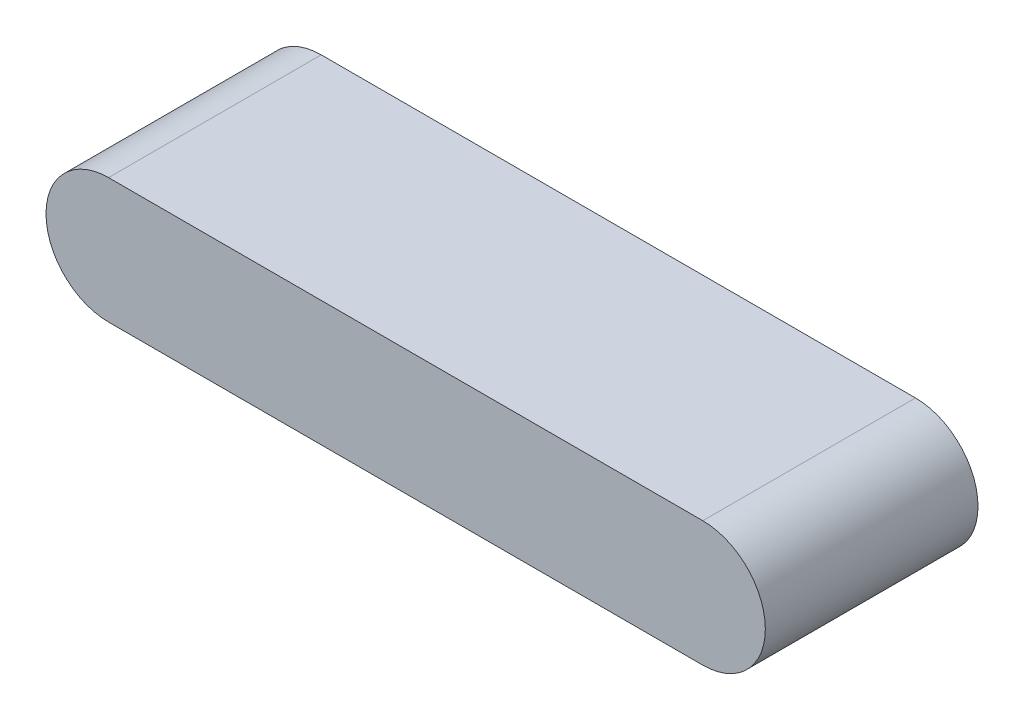
ISO-10303-21;
HEADER;
FILE_DESCRIPTION(('STEP AP214'),'2;1');
FILE_NAME('part.step','',(''),(''),'','','');
FILE_SCHEMA(('AUTOMOTIVE_DESIGN { 1 0 10303 214 1 1 1 1 }'));
ENDSEC;
DATA;
#1=APPLICATION_CONTEXT('core data for automotive mechanical design processes');
#2=APPLICATION_PROTOCOL_DEFINITION('international standard','automotive_design',2000,#1);
#3=PRODUCT_CONTEXT('',#1,'mechanical');
#4=PRODUCT('Part','Part','',(#3));
#5=PRODUCT_RELATED_PRODUCT_CATEGORY('part','',(#4));
#6=PRODUCT_DEFINITION_FORMATION('','',#4);
#7=PRODUCT_DEFINITION_CONTEXT('part definition',#1,'design');
#8=PRODUCT_DEFINITION('design','',#6,#7);
#9=PRODUCT_DEFINITION_SHAPE('','',#8);
#10=(LENGTH_UNIT() NAMED_UNIT(*) SI_UNIT(.MILLI.,.METRE.));
#11=(NAMED_UNIT(*) PLANE_ANGLE_UNIT() SI_UNIT($,.RADIAN.));
#12=(NAMED_UNIT(*) SI_UNIT($,.STERADIAN.) SOLID_ANGLE_UNIT());
#13=UNCERTAINTY_MEASURE_WITH_UNIT(LENGTH_MEASURE(1.E-05),#10,'distance_accuracy_value','');
#14=(GEOMETRIC_REPRESENTATION_CONTEXT(3) GLOBAL_UNCERTAINTY_ASSIGNED_CONTEXT((#13)) GLOBAL_UNIT_ASSIGNED_CONTEXT((#10,
#11,#12)) REPRESENTATION_CONTEXT('',''));
#15=CARTESIAN_POINT('',(0.,0.,0.));
#16=DIRECTION('',(0.,0.,1.));
#17=DIRECTION('',(1.,0.,0.));
#18=AXIS2_PLACEMENT_3D('',#15,#16,#17);
#19=CARTESIAN_POINT('',(0.,0.,0.));
#20=DIRECTION('',(0.,0.,1.));
#21=DIRECTION('',(1.,0.,0.));
#22=AXIS2_PLACEMENT_3D('',#19,#20,#21);
#23=PLANE('',#22);
#24=CARTESIAN_POINT('',(14.25,0.,0.));
#25=DIRECTION('',(0.,0.,-1.));
#26=DIRECTION('',(-1.,0.,0.));
#27=AXIS2_PLACEMENT_3D('',#24,#25,#26);
#28=CIRCLE('',#27,2.5);
#29=CARTESIAN_POINT('',(14.25,2.5,0.));
#30=VERTEX_POINT('',#29);
#31=CARTESIAN_POINT('',(14.25,-2.5,0.));
#32=VERTEX_POINT('',#31);
#33=EDGE_CURVE('E20',#30,#32,#28,.T.);
#34=ORIENTED_EDGE('',*,*,#33,.T.);
#35=DIRECTION('',(1.,0.,0.));
#36=VECTOR('',#35,1.);
#37=CARTESIAN_POINT('',(-14.25,-2.5,0.));
#38=LINE('',#37,#36);
#39=CARTESIAN_POINT('',(-14.25,-2.5,0.));
#40=VERTEX_POINT('',#39);
#41=EDGE_CURVE('E69',#40,#32,#38,.T.);
#42=ORIENTED_EDGE('',*,*,#41,.F.);
#43=CARTESIAN_POINT('',(-14.25,0.,0.));
#44=DIRECTION('',(0.,0.,-1.));
#45=DIRECTION('',(-1.,0.,0.));
#46=AXIS2_PLACEMENT_3D('',#43,#44,#45);
#47=CIRCLE('',#46,2.5);
#48=CARTESIAN_POINT('',(-14.25,2.5,0.));
#49=VERTEX_POINT('',#48);
#50=EDGE_CURVE('E115',#40,#49,#47,.T.);
#51=ORIENTED_EDGE('',*,*,#50,.T.);
#52=DIRECTION('',(1.,0.,0.));
#53=VECTOR('',#52,1.);
#54=CARTESIAN_POINT('',(14.25,2.5,0.));
#55=LINE('',#54,#53);
#56=EDGE_CURVE('E64',#30,#49,#55,.F.);
#57=ORIENTED_EDGE('',*,*,#56,.F.);
#58=EDGE_LOOP('',(#34,#42,#51,#57));
#59=FACE_BOUND('',#58,.T.);
#60=ADVANCED_FACE('F17',(#59),#23,.F.);
#61=CARTESIAN_POINT('',(14.25,3.,0.));
#62=DIRECTION('',(0.,1.,0.));
#63=DIRECTION('',(0.,0.,1.));
#64=AXIS2_PLACEMENT_3D('',#61,#62,#63);
#65=PLANE('',#64);
#66=DIRECTION('',(0.,0.,1.));
#67=VECTOR('',#66,1.);
#68=CARTESIAN_POINT('',(14.25,3.,0.));
#69=LINE('',#68,#67);
#70=CARTESIAN_POINT('',(14.25,3.,-9.7));
#71=VERTEX_POINT('',#70);
#72=CARTESIAN_POINT('',(14.25,3.,0.5));
#73=VERTEX_POINT('',#72);
#74=EDGE_CURVE('E114',#71,#73,#69,.T.);
#75=ORIENTED_EDGE('',*,*,#74,.F.);
#76=DIRECTION('',(1.,0.,0.));
#77=VECTOR('',#76,1.);
#78=CARTESIAN_POINT('',(0.,3.,-9.7));
#79=LINE('',#78,#77);
#80=CARTESIAN_POINT('',(-14.25,3.,-9.7));
#81=VERTEX_POINT('',#80);
#82=EDGE_CURVE('E107',#71,#81,#79,.F.);
#83=ORIENTED_EDGE('',*,*,#82,.T.);
#84=DIRECTION('',(0.,0.,1.));
#85=VECTOR('',#84,1.);
#86=CARTESIAN_POINT('',(-14.25,3.,0.));
#87=LINE('',#86,#85);
#88=CARTESIAN_POINT('',(-14.25,3.,0.5));
#89=VERTEX_POINT('',#88);
#90=EDGE_CURVE('E93',#89,#81,#87,.F.);
#91=ORIENTED_EDGE('',*,*,#90,.F.);
#92=DIRECTION('',(1.,0.,0.));
#93=VECTOR('',#92,1.);
#94=CARTESIAN_POINT('',(0.,3.,0.5));
#95=LINE('',#94,#93);
#96=EDGE_CURVE('E111',#73,#89,#95,.F.);
#97=ORIENTED_EDGE('',*,*,#96,.F.);
#98=EDGE_LOOP('',(#75,#83,#91,#97));
#99=FACE_BOUND('',#98,.T.);
#100=ADVANCED_FACE('F153',(#99),#65,.T.);
#101=CARTESIAN_POINT('',(14.25,2.5,0.));
#102=DIRECTION('',(0.,-1.,0.));
#103=DIRECTION('',(0.,0.,-1.));
#104=AXIS2_PLACEMENT_3D('',#101,#102,#103);
#105=PLANE('',#104);
#106=DIRECTION('',(1.,0.,0.));
#107=VECTOR('',#106,1.);
#108=CARTESIAN_POINT('',(0.,2.5,-9.7));
#109=LINE('',#108,#107);
#110=CARTESIAN_POINT('',(-14.25,2.5,-9.7));
#111=VERTEX_POINT('',#110);
#112=CARTESIAN_POINT('',(14.25,2.5,-9.7));
#113=VERTEX_POINT('',#112);
#114=EDGE_CURVE('E102',#111,#113,#109,.T.);
#115=ORIENTED_EDGE('',*,*,#114,.T.);
#116=DIRECTION('',(0.,0.,-1.));
#117=VECTOR('',#116,1.);
#118=CARTESIAN_POINT('',(14.25,2.5,0.));
#119=LINE('',#118,#117);
#120=EDGE_CURVE('E73',#113,#30,#119,.F.);
#121=ORIENTED_EDGE('',*,*,#120,.T.);
#122=ORIENTED_EDGE('',*,*,#56,.T.);
#123=DIRECTION('',(0.,0.,-1.));
#124=VECTOR('',#123,1.);
#125=CARTESIAN_POINT('',(-14.25,2.5,0.));
#126=LINE('',#125,#124);
#127=EDGE_CURVE('E84',#49,#111,#126,.T.);
#128=ORIENTED_EDGE('',*,*,#127,.T.);
#129=EDGE_LOOP('',(#115,#121,#122,#128));
#130=FACE_BOUND('',#129,.T.);
#131=ADVANCED_FACE('F124',(#130),#105,.T.);
#132=CARTESIAN_POINT('',(14.25,0.,0.));
#133=DIRECTION('',(0.,0.,-1.));
#134=DIRECTION('',(-1.,0.,0.));
#135=AXIS2_PLACEMENT_3D('',#132,#133,#134);
#136=CYLINDRICAL_SURFACE('',#135,2.5);
#137=ORIENTED_EDGE('',*,*,#120,.F.);
#138=CARTESIAN_POINT('',(14.25,0.,-9.7));
#139=DIRECTION('',(0.,0.,-1.));
#140=DIRECTION('',(-1.,0.,0.));
#141=AXIS2_PLACEMENT_3D('',#138,#139,#140);
#142=CIRCLE('',#141,2.5);
#143=CARTESIAN_POINT('',(14.25,-2.5,-9.7));
#144=VERTEX_POINT('',#143);
#145=EDGE_CURVE('E80',#113,#144,#142,.T.);
#146=ORIENTED_EDGE('',*,*,#145,.T.);
#147=DIRECTION('',(0.,0.,1.));
#148=VECTOR('',#147,1.);
#149=CARTESIAN_POINT('',(14.25,-2.5,0.));
#150=LINE('',#149,#148);
#151=EDGE_CURVE('E76',#32,#144,#150,.F.);
#152=ORIENTED_EDGE('',*,*,#151,.F.);
#153=ORIENTED_EDGE('',*,*,#33,.F.);
#154=EDGE_LOOP('',(#137,#146,#152,#153));
#155=FACE_BOUND('',#154,.T.);
#156=ADVANCED_FACE('F77',(#155),#136,.F.);
#157=CARTESIAN_POINT('',(-14.25,-2.5,0.));
#158=DIRECTION('',(0.,1.,0.));
#159=DIRECTION('',(0.,0.,1.));
#160=AXIS2_PLACEMENT_3D('',#157,#158,#159);
#161=PLANE('',#160);
#162=DIRECTION('',(1.,0.,0.));
#163=VECTOR('',#162,1.);
#164=CARTESIAN_POINT('',(0.,-2.5,-9.7));
#165=LINE('',#164,#163);
#166=CARTESIAN_POINT('',(-14.25,-2.5,-9.7));
#167=VERTEX_POINT('',#166);
#168=EDGE_CURVE('E100',#144,#167,#165,.F.);
#169=ORIENTED_EDGE('',*,*,#168,.T.);
#170=DIRECTION('',(0.,0.,-1.));
#171=VECTOR('',#170,1.);
#172=CARTESIAN_POINT('',(-14.25,-2.5,0.));
#173=LINE('',#172,#171);
#174=EDGE_CURVE('E88',#167,#40,#173,.F.);
#175=ORIENTED_EDGE('',*,*,#174,.T.);
#176=ORIENTED_EDGE('',*,*,#41,.T.);
#177=ORIENTED_EDGE('',*,*,#151,.T.);
#178=EDGE_LOOP('',(#169,#175,#176,#177));
#179=FACE_BOUND('',#178,.T.);
#180=ADVANCED_FACE('F86',(#179),#161,.T.);
#181=CARTESIAN_POINT('',(-14.25,0.,0.));
#182=DIRECTION('',(0.,0.,-1.));
#183=DIRECTION('',(-1.,0.,0.));
#184=AXIS2_PLACEMENT_3D('',#181,#182,#183);
#185=CYLINDRICAL_SURFACE('',#184,2.5);
#186=ORIENTED_EDGE('',*,*,#174,.F.);
#187=CARTESIAN_POINT('',(-14.25,0.,-9.7));
#188=DIRECTION('',(0.,0.,-1.));
#189=DIRECTION('',(-1.,0.,0.));
#190=AXIS2_PLACEMENT_3D('',#187,#188,#189);
#191=CIRCLE('',#190,2.5);
#192=EDGE_CURVE('E96',#167,#111,#191,.T.);
#193=ORIENTED_EDGE('',*,*,#192,.T.);
#194=ORIENTED_EDGE('',*,*,#127,.F.);
#195=ORIENTED_EDGE('',*,*,#50,.F.);
#196=EDGE_LOOP('',(#186,#193,#194,#195));
#197=FACE_BOUND('',#196,.T.);
#198=ADVANCED_FACE('F166',(#197),#185,.F.);
#199=CARTESIAN_POINT('',(14.25,0.,0.));
#200=DIRECTION('',(0.,0.,1.));
#201=DIRECTION('',(1.,0.,0.));
#202=AXIS2_PLACEMENT_3D('',#199,#200,#201);
#203=CYLINDRICAL_SURFACE('',#202,3.);
#204=DIRECTION('',(0.,0.,-1.));
#205=VECTOR('',#204,1.);
#206=CARTESIAN_POINT('',(14.25,-3.,0.));
#207=LINE('',#206,#205);
#208=CARTESIAN_POINT('',(14.25,-3.,-9.7));
#209=VERTEX_POINT('',#208);
#210=CARTESIAN_POINT('',(14.25,-3.,0.5));
#211=VERTEX_POINT('',#210);
#212=EDGE_CURVE('E99',#209,#211,#207,.F.);
#213=ORIENTED_EDGE('',*,*,#212,.F.);
#214=CARTESIAN_POINT('',(14.25,0.,-9.7));
#215=DIRECTION('',(0.,0.,1.));
#216=DIRECTION('',(1.,0.,0.));
#217=AXIS2_PLACEMENT_3D('',#214,#215,#216);
#218=CIRCLE('',#217,3.);
#219=EDGE_CURVE('E103',#209,#71,#218,.T.);
#220=ORIENTED_EDGE('',*,*,#219,.T.);
#221=ORIENTED_EDGE('',*,*,#74,.T.);
#222=CARTESIAN_POINT('',(14.25,0.,0.5));
#223=DIRECTION('',(0.,0.,1.));
#224=DIRECTION('',(1.,0.,0.));
#225=AXIS2_PLACEMENT_3D('',#222,#223,#224);
#226=CIRCLE('',#225,3.);
#227=EDGE_CURVE('E112',#211,#73,#226,.T.);
#228=ORIENTED_EDGE('',*,*,#227,.F.);
#229=EDGE_LOOP('',(#213,#220,#221,#228));
#230=FACE_BOUND('',#229,.T.);
#231=ADVANCED_FACE('F161',(#230),#203,.T.);
#232=CARTESIAN_POINT('',(0.,0.,0.5));
#233=DIRECTION('',(0.,0.,1.));
#234=DIRECTION('',(1.,0.,0.));
#235=AXIS2_PLACEMENT_3D('',#232,#233,#234);
#236=PLANE('',#235);
#237=CARTESIAN_POINT('',(-14.25,0.,0.5));
#238=DIRECTION('',(0.,0.,1.));
#239=DIRECTION('',(1.,0.,0.));
#240=AXIS2_PLACEMENT_3D('',#237,#238,#239);
#241=CIRCLE('',#240,3.);
#242=CARTESIAN_POINT('',(-14.25,-3.,0.5));
#243=VERTEX_POINT('',#242);
#244=EDGE_CURVE('E108',#243,#89,#241,.F.);
#245=ORIENTED_EDGE('',*,*,#244,.F.);
#246=DIRECTION('',(1.,0.,0.));
#247=VECTOR('',#246,1.);
#248=CARTESIAN_POINT('',(-14.25,-3.,0.5));
#249=LINE('',#248,#247);
#250=EDGE_CURVE('E141',#211,#243,#249,.F.);
#251=ORIENTED_EDGE('',*,*,#250,.F.);
#252=ORIENTED_EDGE('',*,*,#227,.T.);
#253=ORIENTED_EDGE('',*,*,#96,.T.);
#254=EDGE_LOOP('',(#245,#251,#252,#253));
#255=FACE_BOUND('',#254,.T.);
#256=ADVANCED_FACE('F149',(#255),#236,.T.);
#257=CARTESIAN_POINT('',(-14.25,0.,0.));
#258=DIRECTION('',(0.,0.,1.));
#259=DIRECTION('',(1.,0.,0.));
#260=AXIS2_PLACEMENT_3D('',#257,#258,#259);
#261=CYLINDRICAL_SURFACE('',#260,3.);
#262=ORIENTED_EDGE('',*,*,#90,.T.);
#263=CARTESIAN_POINT('',(-14.25,0.,-9.7));
#264=DIRECTION('',(0.,0.,1.));
#265=DIRECTION('',(1.,0.,0.));
#266=AXIS2_PLACEMENT_3D('',#263,#264,#265);
#267=CIRCLE('',#266,3.);
#268=CARTESIAN_POINT('',(-14.25,-3.,-9.7));
#269=VERTEX_POINT('',#268);
#270=EDGE_CURVE('E35',#81,#269,#267,.T.);
#271=ORIENTED_EDGE('',*,*,#270,.T.);
#272=DIRECTION('',(0.,0.,-1.));
#273=VECTOR('',#272,1.);
#274=CARTESIAN_POINT('',(-14.25,-3.,0.));
#275=LINE('',#274,#273);
#276=EDGE_CURVE('E26',#243,#269,#275,.T.);
#277=ORIENTED_EDGE('',*,*,#276,.F.);
#278=ORIENTED_EDGE('',*,*,#244,.T.);
#279=EDGE_LOOP('',(#262,#271,#277,#278));
#280=FACE_BOUND('',#279,.T.);
#281=ADVANCED_FACE('F155',(#280),#261,.T.);
#282=CARTESIAN_POINT('',(0.,0.,-9.7));
#283=DIRECTION('',(0.,0.,1.));
#284=DIRECTION('',(1.,0.,0.));
#285=AXIS2_PLACEMENT_3D('',#282,#283,#284);
#286=PLANE('',#285);
#287=ORIENTED_EDGE('',*,*,#168,.F.);
#288=ORIENTED_EDGE('',*,*,#145,.F.);
#289=ORIENTED_EDGE('',*,*,#114,.F.);
#290=ORIENTED_EDGE('',*,*,#192,.F.);
#291=EDGE_LOOP('',(#287,#288,#289,#290));
#292=FACE_BOUND('',#291,.T.);
#293=DIRECTION('',(1.,0.,0.));
#294=VECTOR('',#293,1.);
#295=CARTESIAN_POINT('',(-14.25,-3.,-9.7));
#296=LINE('',#295,#294);
#297=EDGE_CURVE('E11',#269,#209,#296,.T.);
#298=ORIENTED_EDGE('',*,*,#297,.F.);
#299=ORIENTED_EDGE('',*,*,#270,.F.);
#300=ORIENTED_EDGE('',*,*,#82,.F.);
#301=ORIENTED_EDGE('',*,*,#219,.F.);
#302=EDGE_LOOP('',(#298,#299,#300,#301));
#303=FACE_BOUND('',#302,.T.);
#304=ADVANCED_FACE('F130',(#292,#303),#286,.F.);
#305=CARTESIAN_POINT('',(-14.25,-3.,0.));
#306=DIRECTION('',(0.,-1.,0.));
#307=DIRECTION('',(0.,0.,-1.));
#308=AXIS2_PLACEMENT_3D('',#305,#306,#307);
#309=PLANE('',#308);
#310=ORIENTED_EDGE('',*,*,#276,.T.);
#311=ORIENTED_EDGE('',*,*,#297,.T.);
#312=ORIENTED_EDGE('',*,*,#212,.T.);
#313=ORIENTED_EDGE('',*,*,#250,.T.);
#314=EDGE_LOOP('',(#310,#311,#312,#313));
#315=FACE_BOUND('',#314,.T.);
#316=ADVANCED_FACE('F157',(#315),#309,.T.);
#317=CLOSED_SHELL('',(#60,#100,#131,#156,#180,#198,#231,#256,#281,#304,#316));
#318=MANIFOLD_SOLID_BREP('B1',#317);
#319=ADVANCED_BREP_SHAPE_REPRESENTATION('',(#18,#318),#14);
#320=SHAPE_DEFINITION_REPRESENTATION(#9,#319);
ENDSEC;
END-ISO-10303-21;
